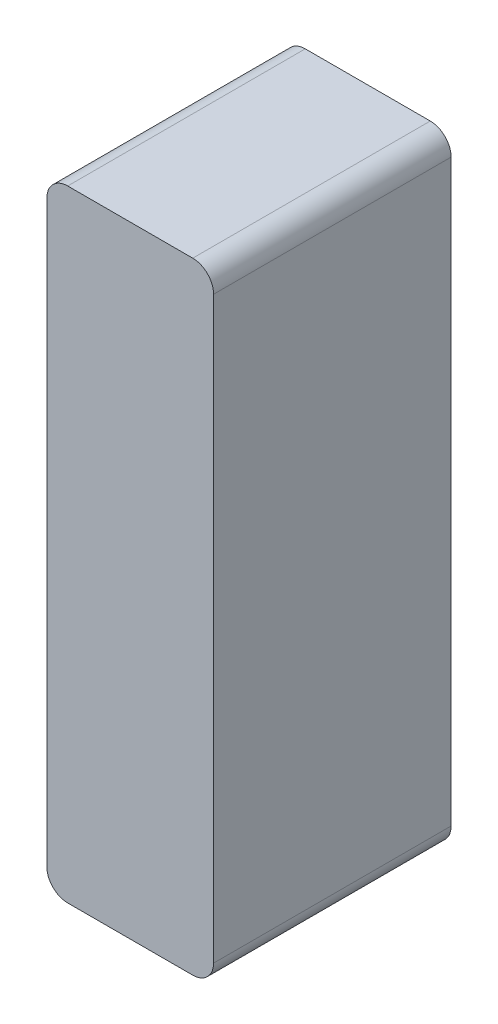
ISO-10303-21;
HEADER;
FILE_DESCRIPTION(('STEP AP214'),'2;1');
FILE_NAME('part.step','',(''),(''),'','','');
FILE_SCHEMA(('AUTOMOTIVE_DESIGN { 1 0 10303 214 1 1 1 1 }'));
ENDSEC;
DATA;
#1=APPLICATION_CONTEXT('core data for automotive mechanical design processes');
#2=APPLICATION_PROTOCOL_DEFINITION('international standard','automotive_design',2000,#1);
#3=PRODUCT_CONTEXT('',#1,'mechanical');
#4=PRODUCT('Part','Part','',(#3));
#5=PRODUCT_RELATED_PRODUCT_CATEGORY('part','',(#4));
#6=PRODUCT_DEFINITION_FORMATION('','',#4);
#7=PRODUCT_DEFINITION_CONTEXT('part definition',#1,'design');
#8=PRODUCT_DEFINITION('design','',#6,#7);
#9=PRODUCT_DEFINITION_SHAPE('','',#8);
#10=(LENGTH_UNIT() NAMED_UNIT(*) SI_UNIT(.MILLI.,.METRE.));
#11=(NAMED_UNIT(*) PLANE_ANGLE_UNIT() SI_UNIT($,.RADIAN.));
#12=(NAMED_UNIT(*) SI_UNIT($,.STERADIAN.) SOLID_ANGLE_UNIT());
#13=UNCERTAINTY_MEASURE_WITH_UNIT(LENGTH_MEASURE(1.E-05),#10,'distance_accuracy_value','');
#14=(GEOMETRIC_REPRESENTATION_CONTEXT(3) GLOBAL_UNCERTAINTY_ASSIGNED_CONTEXT((#13)) GLOBAL_UNIT_ASSIGNED_CONTEXT((#10,
#11,#12)) REPRESENTATION_CONTEXT('',''));
#15=CARTESIAN_POINT('',(0.,0.,0.));
#16=DIRECTION('',(0.,0.,1.));
#17=DIRECTION('',(1.,0.,0.));
#18=AXIS2_PLACEMENT_3D('',#15,#16,#17);
#19=CARTESIAN_POINT('',(4.,-14.9,11.4));
#20=DIRECTION('',(-1.,0.,0.));
#21=DIRECTION('',(0.,0.,1.));
#22=AXIS2_PLACEMENT_3D('',#19,#20,#21);
#23=PLANE('',#22);
#24=DIRECTION('',(0.,1.,0.));
#25=VECTOR('',#24,1.);
#26=CARTESIAN_POINT('',(4.,-14.9,11.4));
#27=LINE('',#26,#25);
#28=CARTESIAN_POINT('',(4.,-13.9,11.4));
#29=VERTEX_POINT('',#28);
#30=CARTESIAN_POINT('',(4.,13.9,11.4));
#31=VERTEX_POINT('',#30);
#32=EDGE_CURVE('E132',#29,#31,#27,.T.);
#33=ORIENTED_EDGE('',*,*,#32,.F.);
#34=DIRECTION('',(0.,0.,-1.));
#35=VECTOR('',#34,1.);
#36=CARTESIAN_POINT('',(4.,-13.9,11.4));
#37=LINE('',#36,#35);
#38=CARTESIAN_POINT('',(4.,-13.9,0.));
#39=VERTEX_POINT('',#38);
#40=EDGE_CURVE('E158',#29,#39,#37,.T.);
#41=ORIENTED_EDGE('',*,*,#40,.T.);
#42=DIRECTION('',(0.,1.,0.));
#43=VECTOR('',#42,1.);
#44=CARTESIAN_POINT('',(4.,-14.9,0.));
#45=LINE('',#44,#43);
#46=CARTESIAN_POINT('',(4.,13.9,0.));
#47=VERTEX_POINT('',#46);
#48=EDGE_CURVE('E166',#39,#47,#45,.T.);
#49=ORIENTED_EDGE('',*,*,#48,.T.);
#50=DIRECTION('',(0.,0.,-1.));
#51=VECTOR('',#50,1.);
#52=CARTESIAN_POINT('',(4.,13.9,11.4));
#53=LINE('',#52,#51);
#54=EDGE_CURVE('E156',#47,#31,#53,.F.);
#55=ORIENTED_EDGE('',*,*,#54,.T.);
#56=EDGE_LOOP('',(#33,#41,#49,#55));
#57=FACE_BOUND('',#56,.T.);
#58=ADVANCED_FACE('F41',(#57),#23,.F.);
#59=CARTESIAN_POINT('',(-4.,14.9,11.4));
#60=DIRECTION('',(0.,-1.,0.));
#61=DIRECTION('',(0.,0.,-1.));
#62=AXIS2_PLACEMENT_3D('',#59,#60,#61);
#63=PLANE('',#62);
#64=DIRECTION('',(-1.,0.,0.));
#65=VECTOR('',#64,1.);
#66=CARTESIAN_POINT('',(-4.,14.9,0.));
#67=LINE('',#66,#65);
#68=CARTESIAN_POINT('',(3.,14.9,0.));
#69=VERTEX_POINT('',#68);
#70=CARTESIAN_POINT('',(-3.,14.9,0.));
#71=VERTEX_POINT('',#70);
#72=EDGE_CURVE('E137',#69,#71,#67,.T.);
#73=ORIENTED_EDGE('',*,*,#72,.T.);
#74=DIRECTION('',(0.,0.,-1.));
#75=VECTOR('',#74,1.);
#76=CARTESIAN_POINT('',(-3.,14.9,11.4));
#77=LINE('',#76,#75);
#78=CARTESIAN_POINT('',(-3.,14.9,11.4));
#79=VERTEX_POINT('',#78);
#80=EDGE_CURVE('E11',#71,#79,#77,.F.);
#81=ORIENTED_EDGE('',*,*,#80,.T.);
#82=DIRECTION('',(-1.,0.,0.));
#83=VECTOR('',#82,1.);
#84=CARTESIAN_POINT('',(-4.,14.9,11.4));
#85=LINE('',#84,#83);
#86=CARTESIAN_POINT('',(3.,14.9,11.4));
#87=VERTEX_POINT('',#86);
#88=EDGE_CURVE('E135',#87,#79,#85,.T.);
#89=ORIENTED_EDGE('',*,*,#88,.F.);
#90=DIRECTION('',(0.,0.,-1.));
#91=VECTOR('',#90,1.);
#92=CARTESIAN_POINT('',(3.,14.9,11.4));
#93=LINE('',#92,#91);
#94=EDGE_CURVE('E49',#87,#69,#93,.T.);
#95=ORIENTED_EDGE('',*,*,#94,.T.);
#96=EDGE_LOOP('',(#73,#81,#89,#95));
#97=FACE_BOUND('',#96,.T.);
#98=ADVANCED_FACE('F163',(#97),#63,.F.);
#99=CARTESIAN_POINT('',(-4.,-14.9,11.4));
#100=DIRECTION('',(1.,0.,0.));
#101=DIRECTION('',(0.,0.,-1.));
#102=AXIS2_PLACEMENT_3D('',#99,#100,#101);
#103=PLANE('',#102);
#104=DIRECTION('',(0.,-1.,0.));
#105=VECTOR('',#104,1.);
#106=CARTESIAN_POINT('',(-4.,-14.9,0.));
#107=LINE('',#106,#105);
#108=CARTESIAN_POINT('',(-4.,13.9,0.));
#109=VERTEX_POINT('',#108);
#110=CARTESIAN_POINT('',(-4.,-13.9,0.));
#111=VERTEX_POINT('',#110);
#112=EDGE_CURVE('E133',#109,#111,#107,.T.);
#113=ORIENTED_EDGE('',*,*,#112,.T.);
#114=DIRECTION('',(0.,0.,-1.));
#115=VECTOR('',#114,1.);
#116=CARTESIAN_POINT('',(-4.,-13.9,11.4));
#117=LINE('',#116,#115);
#118=CARTESIAN_POINT('',(-4.,-13.9,11.4));
#119=VERTEX_POINT('',#118);
#120=EDGE_CURVE('E111',#111,#119,#117,.F.);
#121=ORIENTED_EDGE('',*,*,#120,.T.);
#122=DIRECTION('',(0.,-1.,0.));
#123=VECTOR('',#122,1.);
#124=CARTESIAN_POINT('',(-4.,-14.9,11.4));
#125=LINE('',#124,#123);
#126=CARTESIAN_POINT('',(-4.,13.9,11.4));
#127=VERTEX_POINT('',#126);
#128=EDGE_CURVE('E170',#127,#119,#125,.T.);
#129=ORIENTED_EDGE('',*,*,#128,.F.);
#130=DIRECTION('',(0.,0.,-1.));
#131=VECTOR('',#130,1.);
#132=CARTESIAN_POINT('',(-4.,13.9,11.4));
#133=LINE('',#132,#131);
#134=EDGE_CURVE('E116',#127,#109,#133,.T.);
#135=ORIENTED_EDGE('',*,*,#134,.T.);
#136=EDGE_LOOP('',(#113,#121,#129,#135));
#137=FACE_BOUND('',#136,.T.);
#138=ADVANCED_FACE('F180',(#137),#103,.F.);
#139=CARTESIAN_POINT('',(-4.,-14.9,11.4));
#140=DIRECTION('',(0.,1.,0.));
#141=DIRECTION('',(0.,0.,1.));
#142=AXIS2_PLACEMENT_3D('',#139,#140,#141);
#143=PLANE('',#142);
#144=DIRECTION('',(1.,0.,0.));
#145=VECTOR('',#144,1.);
#146=CARTESIAN_POINT('',(-4.,-14.9,11.4));
#147=LINE('',#146,#145);
#148=CARTESIAN_POINT('',(-3.,-14.9,11.4));
#149=VERTEX_POINT('',#148);
#150=CARTESIAN_POINT('',(3.,-14.9,11.4));
#151=VERTEX_POINT('',#150);
#152=EDGE_CURVE('E126',#149,#151,#147,.T.);
#153=ORIENTED_EDGE('',*,*,#152,.F.);
#154=DIRECTION('',(0.,0.,-1.));
#155=VECTOR('',#154,1.);
#156=CARTESIAN_POINT('',(-3.,-14.9,11.4));
#157=LINE('',#156,#155);
#158=CARTESIAN_POINT('',(-3.,-14.9,0.));
#159=VERTEX_POINT('',#158);
#160=EDGE_CURVE('E110',#149,#159,#157,.T.);
#161=ORIENTED_EDGE('',*,*,#160,.T.);
#162=DIRECTION('',(1.,0.,0.));
#163=VECTOR('',#162,1.);
#164=CARTESIAN_POINT('',(-4.,-14.9,0.));
#165=LINE('',#164,#163);
#166=CARTESIAN_POINT('',(3.,-14.9,0.));
#167=VERTEX_POINT('',#166);
#168=EDGE_CURVE('E123',#159,#167,#165,.T.);
#169=ORIENTED_EDGE('',*,*,#168,.T.);
#170=DIRECTION('',(0.,0.,-1.));
#171=VECTOR('',#170,1.);
#172=CARTESIAN_POINT('',(3.,-14.9,11.4));
#173=LINE('',#172,#171);
#174=EDGE_CURVE('E128',#167,#151,#173,.F.);
#175=ORIENTED_EDGE('',*,*,#174,.T.);
#176=EDGE_LOOP('',(#153,#161,#169,#175));
#177=FACE_BOUND('',#176,.T.);
#178=ADVANCED_FACE('F122',(#177),#143,.F.);
#179=CARTESIAN_POINT('',(0.,0.,11.4));
#180=DIRECTION('',(0.,0.,-1.));
#181=DIRECTION('',(-1.,0.,0.));
#182=AXIS2_PLACEMENT_3D('',#179,#180,#181);
#183=PLANE('',#182);
#184=ORIENTED_EDGE('',*,*,#128,.T.);
#185=CARTESIAN_POINT('',(-3.,-13.9,11.4));
#186=DIRECTION('',(0.,0.,-1.));
#187=DIRECTION('',(-1.,0.,0.));
#188=AXIS2_PLACEMENT_3D('',#185,#186,#187);
#189=CIRCLE('',#188,1.);
#190=EDGE_CURVE('E154',#119,#149,#189,.F.);
#191=ORIENTED_EDGE('',*,*,#190,.T.);
#192=ORIENTED_EDGE('',*,*,#152,.T.);
#193=CARTESIAN_POINT('',(3.,-13.9,11.4));
#194=DIRECTION('',(0.,0.,-1.));
#195=DIRECTION('',(-1.,0.,0.));
#196=AXIS2_PLACEMENT_3D('',#193,#194,#195);
#197=CIRCLE('',#196,1.);
#198=EDGE_CURVE('E152',#151,#29,#197,.F.);
#199=ORIENTED_EDGE('',*,*,#198,.T.);
#200=ORIENTED_EDGE('',*,*,#32,.T.);
#201=CARTESIAN_POINT('',(3.,13.9,11.4));
#202=DIRECTION('',(0.,0.,-1.));
#203=DIRECTION('',(-1.,0.,0.));
#204=AXIS2_PLACEMENT_3D('',#201,#202,#203);
#205=CIRCLE('',#204,1.);
#206=EDGE_CURVE('E61',#31,#87,#205,.F.);
#207=ORIENTED_EDGE('',*,*,#206,.T.);
#208=ORIENTED_EDGE('',*,*,#88,.T.);
#209=CARTESIAN_POINT('',(-3.,13.9,11.4));
#210=DIRECTION('',(0.,0.,-1.));
#211=DIRECTION('',(-1.,0.,0.));
#212=AXIS2_PLACEMENT_3D('',#209,#210,#211);
#213=CIRCLE('',#212,1.);
#214=EDGE_CURVE('E150',#79,#127,#213,.F.);
#215=ORIENTED_EDGE('',*,*,#214,.T.);
#216=EDGE_LOOP('',(#184,#191,#192,#199,#200,#207,#208,#215));
#217=FACE_BOUND('',#216,.T.);
#218=ADVANCED_FACE('F174',(#217),#183,.F.);
#219=CARTESIAN_POINT('',(0.,0.,0.));
#220=DIRECTION('',(0.,0.,-1.));
#221=DIRECTION('',(-1.,0.,0.));
#222=AXIS2_PLACEMENT_3D('',#219,#220,#221);
#223=PLANE('',#222);
#224=ORIENTED_EDGE('',*,*,#168,.F.);
#225=CARTESIAN_POINT('',(-3.,-13.9,0.));
#226=DIRECTION('',(0.,0.,-1.));
#227=DIRECTION('',(-1.,0.,0.));
#228=AXIS2_PLACEMENT_3D('',#225,#226,#227);
#229=CIRCLE('',#228,1.);
#230=EDGE_CURVE('E106',#159,#111,#229,.T.);
#231=ORIENTED_EDGE('',*,*,#230,.T.);
#232=ORIENTED_EDGE('',*,*,#112,.F.);
#233=CARTESIAN_POINT('',(-3.,13.9,0.));
#234=DIRECTION('',(0.,0.,-1.));
#235=DIRECTION('',(-1.,0.,0.));
#236=AXIS2_PLACEMENT_3D('',#233,#234,#235);
#237=CIRCLE('',#236,1.);
#238=EDGE_CURVE('E143',#109,#71,#237,.T.);
#239=ORIENTED_EDGE('',*,*,#238,.T.);
#240=ORIENTED_EDGE('',*,*,#72,.F.);
#241=CARTESIAN_POINT('',(3.,13.9,0.));
#242=DIRECTION('',(0.,0.,-1.));
#243=DIRECTION('',(-1.,0.,0.));
#244=AXIS2_PLACEMENT_3D('',#241,#242,#243);
#245=CIRCLE('',#244,1.);
#246=EDGE_CURVE('E127',#69,#47,#245,.T.);
#247=ORIENTED_EDGE('',*,*,#246,.T.);
#248=ORIENTED_EDGE('',*,*,#48,.F.);
#249=CARTESIAN_POINT('',(3.,-13.9,0.));
#250=DIRECTION('',(0.,0.,-1.));
#251=DIRECTION('',(-1.,0.,0.));
#252=AXIS2_PLACEMENT_3D('',#249,#250,#251);
#253=CIRCLE('',#252,1.);
#254=EDGE_CURVE('E117',#39,#167,#253,.T.);
#255=ORIENTED_EDGE('',*,*,#254,.T.);
#256=EDGE_LOOP('',(#224,#231,#232,#239,#240,#247,#248,#255));
#257=FACE_BOUND('',#256,.T.);
#258=ADVANCED_FACE('F130',(#257),#223,.T.);
#259=CARTESIAN_POINT('',(-3.,-13.9,11.4));
#260=DIRECTION('',(0.,0.,-1.));
#261=DIRECTION('',(-1.,0.,0.));
#262=AXIS2_PLACEMENT_3D('',#259,#260,#261);
#263=CYLINDRICAL_SURFACE('',#262,1.);
#264=ORIENTED_EDGE('',*,*,#190,.F.);
#265=ORIENTED_EDGE('',*,*,#120,.F.);
#266=ORIENTED_EDGE('',*,*,#230,.F.);
#267=ORIENTED_EDGE('',*,*,#160,.F.);
#268=EDGE_LOOP('',(#264,#265,#266,#267));
#269=FACE_BOUND('',#268,.T.);
#270=ADVANCED_FACE('F109',(#269),#263,.T.);
#271=CARTESIAN_POINT('',(3.,-13.9,11.4));
#272=DIRECTION('',(0.,0.,-1.));
#273=DIRECTION('',(-1.,0.,0.));
#274=AXIS2_PLACEMENT_3D('',#271,#272,#273);
#275=CYLINDRICAL_SURFACE('',#274,1.);
#276=ORIENTED_EDGE('',*,*,#198,.F.);
#277=ORIENTED_EDGE('',*,*,#174,.F.);
#278=ORIENTED_EDGE('',*,*,#254,.F.);
#279=ORIENTED_EDGE('',*,*,#40,.F.);
#280=EDGE_LOOP('',(#276,#277,#278,#279));
#281=FACE_BOUND('',#280,.T.);
#282=ADVANCED_FACE('F185',(#281),#275,.T.);
#283=CARTESIAN_POINT('',(-3.,13.9,11.4));
#284=DIRECTION('',(0.,0.,-1.));
#285=DIRECTION('',(-1.,0.,0.));
#286=AXIS2_PLACEMENT_3D('',#283,#284,#285);
#287=CYLINDRICAL_SURFACE('',#286,1.);
#288=ORIENTED_EDGE('',*,*,#214,.F.);
#289=ORIENTED_EDGE('',*,*,#80,.F.);
#290=ORIENTED_EDGE('',*,*,#238,.F.);
#291=ORIENTED_EDGE('',*,*,#134,.F.);
#292=EDGE_LOOP('',(#288,#289,#290,#291));
#293=FACE_BOUND('',#292,.T.);
#294=ADVANCED_FACE('F178',(#293),#287,.T.);
#295=CARTESIAN_POINT('',(3.,13.9,11.4));
#296=DIRECTION('',(0.,0.,-1.));
#297=DIRECTION('',(-1.,0.,0.));
#298=AXIS2_PLACEMENT_3D('',#295,#296,#297);
#299=CYLINDRICAL_SURFACE('',#298,1.);
#300=ORIENTED_EDGE('',*,*,#206,.F.);
#301=ORIENTED_EDGE('',*,*,#54,.F.);
#302=ORIENTED_EDGE('',*,*,#246,.F.);
#303=ORIENTED_EDGE('',*,*,#94,.F.);
#304=EDGE_LOOP('',(#300,#301,#302,#303));
#305=FACE_BOUND('',#304,.T.);
#306=ADVANCED_FACE('F43',(#305),#299,.T.);
#307=CLOSED_SHELL('',(#58,#98,#138,#178,#218,#258,#270,#282,#294,#306));
#308=MANIFOLD_SOLID_BREP('B2',#307);
#309=ADVANCED_BREP_SHAPE_REPRESENTATION('',(#18,#308),#14);
#310=SHAPE_DEFINITION_REPRESENTATION(#9,#309);
ENDSEC;
END-ISO-10303-21;
